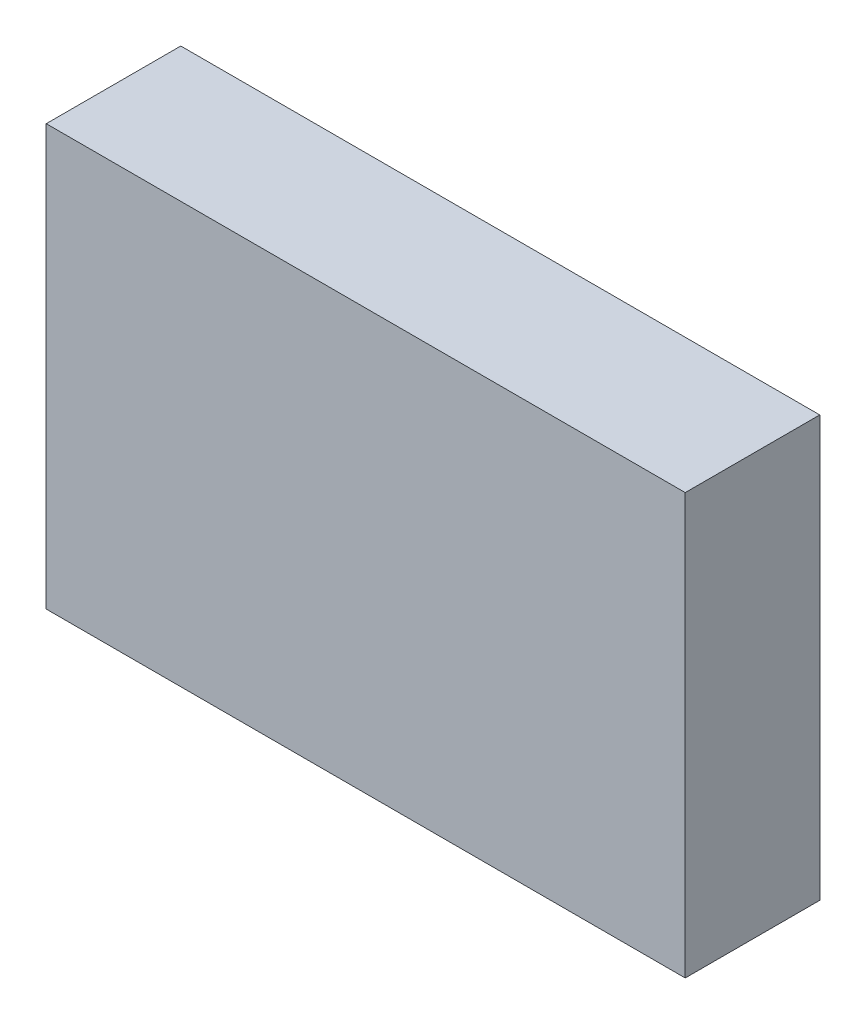
ISO-10303-21;
HEADER;
FILE_DESCRIPTION(('STEP AP214'),'2;1');
FILE_NAME('part.step','',(''),(''),'','','');
FILE_SCHEMA(('AUTOMOTIVE_DESIGN { 1 0 10303 214 1 1 1 1 }'));
ENDSEC;
DATA;
#1=APPLICATION_CONTEXT('core data for automotive mechanical design processes');
#2=APPLICATION_PROTOCOL_DEFINITION('international standard','automotive_design',2000,#1);
#3=PRODUCT_CONTEXT('',#1,'mechanical');
#4=PRODUCT('Part','Part','',(#3));
#5=PRODUCT_RELATED_PRODUCT_CATEGORY('part','',(#4));
#6=PRODUCT_DEFINITION_FORMATION('','',#4);
#7=PRODUCT_DEFINITION_CONTEXT('part definition',#1,'design');
#8=PRODUCT_DEFINITION('design','',#6,#7);
#9=PRODUCT_DEFINITION_SHAPE('','',#8);
#10=(LENGTH_UNIT() NAMED_UNIT(*) SI_UNIT(.MILLI.,.METRE.));
#11=(NAMED_UNIT(*) PLANE_ANGLE_UNIT() SI_UNIT($,.RADIAN.));
#12=(NAMED_UNIT(*) SI_UNIT($,.STERADIAN.) SOLID_ANGLE_UNIT());
#13=UNCERTAINTY_MEASURE_WITH_UNIT(LENGTH_MEASURE(1.E-05),#10,'distance_accuracy_value','');
#14=(GEOMETRIC_REPRESENTATION_CONTEXT(3) GLOBAL_UNCERTAINTY_ASSIGNED_CONTEXT((#13)) GLOBAL_UNIT_ASSIGNED_CONTEXT((#10,
#11,#12)) REPRESENTATION_CONTEXT('',''));
#15=CARTESIAN_POINT('',(0.,0.,0.));
#16=DIRECTION('',(0.,0.,1.));
#17=DIRECTION('',(1.,0.,0.));
#18=AXIS2_PLACEMENT_3D('',#15,#16,#17);
#19=CARTESIAN_POINT('',(0.,0.,0.4));
#20=DIRECTION('',(0.,0.,1.));
#21=DIRECTION('',(1.,0.,0.));
#22=AXIS2_PLACEMENT_3D('',#19,#20,#21);
#23=PLANE('',#22);
#24=DIRECTION('',(-1.,0.,0.));
#25=VECTOR('',#24,1.);
#26=CARTESIAN_POINT('',(-0.95,0.625,0.4));
#27=LINE('',#26,#25);
#28=CARTESIAN_POINT('',(0.95,0.625,0.4));
#29=VERTEX_POINT('',#28);
#30=CARTESIAN_POINT('',(-0.95,0.625,0.4));
#31=VERTEX_POINT('',#30);
#32=EDGE_CURVE('E11',#29,#31,#27,.T.);
#33=ORIENTED_EDGE('',*,*,#32,.T.);
#34=DIRECTION('',(0.,-1.,0.));
#35=VECTOR('',#34,1.);
#36=CARTESIAN_POINT('',(-0.95,-0.625,0.4));
#37=LINE('',#36,#35);
#38=CARTESIAN_POINT('',(-0.95,-0.625,0.4));
#39=VERTEX_POINT('',#38);
#40=EDGE_CURVE('E61',#31,#39,#37,.T.);
#41=ORIENTED_EDGE('',*,*,#40,.T.);
#42=DIRECTION('',(1.,0.,0.));
#43=VECTOR('',#42,1.);
#44=CARTESIAN_POINT('',(0.95,-0.625,0.4));
#45=LINE('',#44,#43);
#46=CARTESIAN_POINT('',(0.95,-0.625,0.4));
#47=VERTEX_POINT('',#46);
#48=EDGE_CURVE('E64',#39,#47,#45,.T.);
#49=ORIENTED_EDGE('',*,*,#48,.T.);
#50=DIRECTION('',(0.,1.,0.));
#51=VECTOR('',#50,1.);
#52=CARTESIAN_POINT('',(0.95,0.625,0.4));
#53=LINE('',#52,#51);
#54=EDGE_CURVE('E94',#47,#29,#53,.T.);
#55=ORIENTED_EDGE('',*,*,#54,.T.);
#56=EDGE_LOOP('',(#33,#41,#49,#55));
#57=FACE_BOUND('',#56,.T.);
#58=ADVANCED_FACE('F16',(#57),#23,.T.);
#59=CARTESIAN_POINT('',(0.,0.,0.));
#60=DIRECTION('',(0.,0.,1.));
#61=DIRECTION('',(1.,0.,0.));
#62=AXIS2_PLACEMENT_3D('',#59,#60,#61);
#63=PLANE('',#62);
#64=DIRECTION('',(1.,0.,0.));
#65=VECTOR('',#64,1.);
#66=CARTESIAN_POINT('',(-0.95,0.625,0.));
#67=LINE('',#66,#65);
#68=CARTESIAN_POINT('',(-0.95,0.625,0.));
#69=VERTEX_POINT('',#68);
#70=CARTESIAN_POINT('',(0.95,0.625,0.));
#71=VERTEX_POINT('',#70);
#72=EDGE_CURVE('E27',#69,#71,#67,.T.);
#73=ORIENTED_EDGE('',*,*,#72,.T.);
#74=DIRECTION('',(0.,-1.,0.));
#75=VECTOR('',#74,1.);
#76=CARTESIAN_POINT('',(0.95,0.625,0.));
#77=LINE('',#76,#75);
#78=CARTESIAN_POINT('',(0.95,-0.625,0.));
#79=VERTEX_POINT('',#78);
#80=EDGE_CURVE('E104',#71,#79,#77,.T.);
#81=ORIENTED_EDGE('',*,*,#80,.T.);
#82=DIRECTION('',(-1.,0.,0.));
#83=VECTOR('',#82,1.);
#84=CARTESIAN_POINT('',(0.95,-0.625,0.));
#85=LINE('',#84,#83);
#86=CARTESIAN_POINT('',(-0.95,-0.625,0.));
#87=VERTEX_POINT('',#86);
#88=EDGE_CURVE('E84',#79,#87,#85,.T.);
#89=ORIENTED_EDGE('',*,*,#88,.T.);
#90=DIRECTION('',(0.,1.,0.));
#91=VECTOR('',#90,1.);
#92=CARTESIAN_POINT('',(-0.95,-0.625,0.));
#93=LINE('',#92,#91);
#94=EDGE_CURVE('E70',#87,#69,#93,.T.);
#95=ORIENTED_EDGE('',*,*,#94,.T.);
#96=EDGE_LOOP('',(#73,#81,#89,#95));
#97=FACE_BOUND('',#96,.T.);
#98=ADVANCED_FACE('F115',(#97),#63,.F.);
#99=CARTESIAN_POINT('',(0.95,0.625,0.));
#100=DIRECTION('',(0.,1.,0.));
#101=DIRECTION('',(1.,0.,0.));
#102=AXIS2_PLACEMENT_3D('',#99,#100,#101);
#103=PLANE('',#102);
#104=ORIENTED_EDGE('',*,*,#72,.F.);
#105=DIRECTION('',(0.,0.,1.));
#106=VECTOR('',#105,1.);
#107=CARTESIAN_POINT('',(-0.95,0.625,0.));
#108=LINE('',#107,#106);
#109=EDGE_CURVE('E69',#69,#31,#108,.T.);
#110=ORIENTED_EDGE('',*,*,#109,.T.);
#111=ORIENTED_EDGE('',*,*,#32,.F.);
#112=DIRECTION('',(0.,0.,1.));
#113=VECTOR('',#112,1.);
#114=CARTESIAN_POINT('',(0.95,0.625,0.));
#115=LINE('',#114,#113);
#116=EDGE_CURVE('E96',#71,#29,#115,.T.);
#117=ORIENTED_EDGE('',*,*,#116,.F.);
#118=EDGE_LOOP('',(#104,#110,#111,#117));
#119=FACE_BOUND('',#118,.T.);
#120=ADVANCED_FACE('F18',(#119),#103,.T.);
#121=CARTESIAN_POINT('',(-0.95,0.625,0.));
#122=DIRECTION('',(-1.,0.,0.));
#123=DIRECTION('',(0.,0.,1.));
#124=AXIS2_PLACEMENT_3D('',#121,#122,#123);
#125=PLANE('',#124);
#126=ORIENTED_EDGE('',*,*,#94,.F.);
#127=DIRECTION('',(0.,0.,1.));
#128=VECTOR('',#127,1.);
#129=CARTESIAN_POINT('',(-0.95,-0.625,0.));
#130=LINE('',#129,#128);
#131=EDGE_CURVE('E73',#87,#39,#130,.T.);
#132=ORIENTED_EDGE('',*,*,#131,.T.);
#133=ORIENTED_EDGE('',*,*,#40,.F.);
#134=ORIENTED_EDGE('',*,*,#109,.F.);
#135=EDGE_LOOP('',(#126,#132,#133,#134));
#136=FACE_BOUND('',#135,.T.);
#137=ADVANCED_FACE('F74',(#136),#125,.T.);
#138=CARTESIAN_POINT('',(-0.95,-0.625,0.));
#139=DIRECTION('',(0.,-1.,0.));
#140=DIRECTION('',(0.,0.,-1.));
#141=AXIS2_PLACEMENT_3D('',#138,#139,#140);
#142=PLANE('',#141);
#143=ORIENTED_EDGE('',*,*,#88,.F.);
#144=DIRECTION('',(0.,0.,1.));
#145=VECTOR('',#144,1.);
#146=CARTESIAN_POINT('',(0.95,-0.625,0.));
#147=LINE('',#146,#145);
#148=EDGE_CURVE('E20',#79,#47,#147,.T.);
#149=ORIENTED_EDGE('',*,*,#148,.T.);
#150=ORIENTED_EDGE('',*,*,#48,.F.);
#151=ORIENTED_EDGE('',*,*,#131,.F.);
#152=EDGE_LOOP('',(#143,#149,#150,#151));
#153=FACE_BOUND('',#152,.T.);
#154=ADVANCED_FACE('F80',(#153),#142,.T.);
#155=CARTESIAN_POINT('',(0.95,-0.625,0.));
#156=DIRECTION('',(1.,0.,0.));
#157=DIRECTION('',(0.,1.,0.));
#158=AXIS2_PLACEMENT_3D('',#155,#156,#157);
#159=PLANE('',#158);
#160=ORIENTED_EDGE('',*,*,#80,.F.);
#161=ORIENTED_EDGE('',*,*,#116,.T.);
#162=ORIENTED_EDGE('',*,*,#54,.F.);
#163=ORIENTED_EDGE('',*,*,#148,.F.);
#164=EDGE_LOOP('',(#160,#161,#162,#163));
#165=FACE_BOUND('',#164,.T.);
#166=ADVANCED_FACE('F117',(#165),#159,.T.);
#167=CLOSED_SHELL('',(#58,#98,#120,#137,#154,#166));
#168=MANIFOLD_SOLID_BREP('B1',#167);
#169=ADVANCED_BREP_SHAPE_REPRESENTATION('',(#18,#168),#14);
#170=SHAPE_DEFINITION_REPRESENTATION(#9,#169);
ENDSEC;
END-ISO-10303-21;
